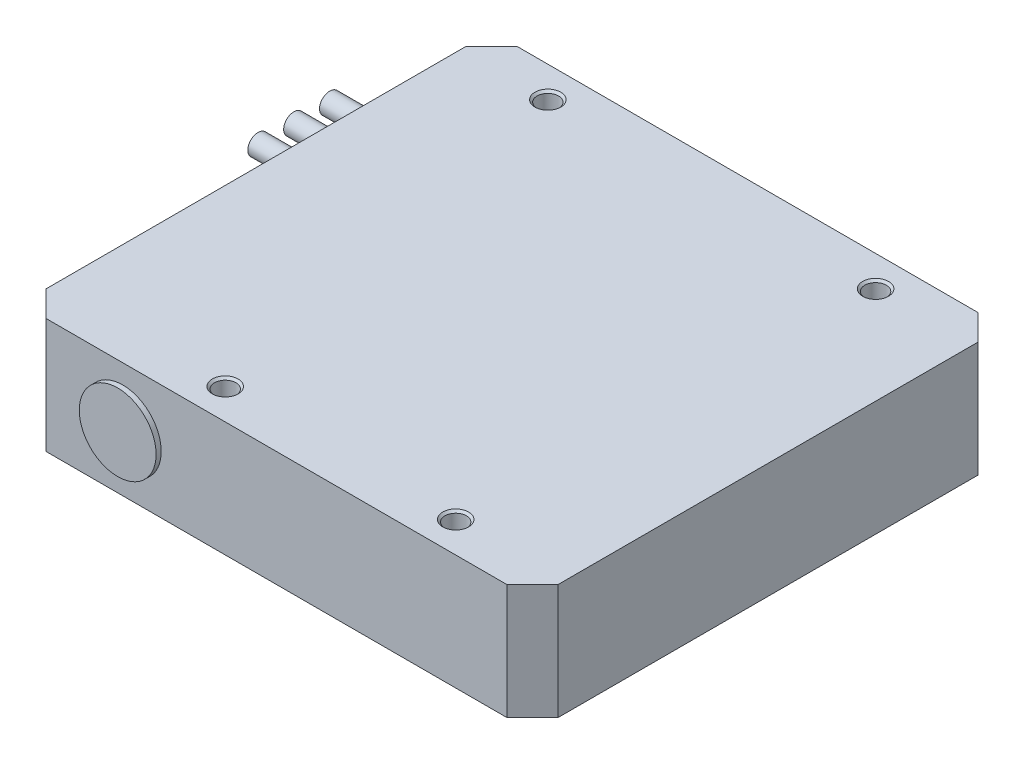
ISO-10303-21;
HEADER;
FILE_DESCRIPTION(('STEP AP214'),'2;1');
FILE_NAME('part.step','',(''),(''),'','','');
FILE_SCHEMA(('AUTOMOTIVE_DESIGN { 1 0 10303 214 1 1 1 1 }'));
ENDSEC;
DATA;
#1=APPLICATION_CONTEXT('core data for automotive mechanical design processes');
#2=APPLICATION_PROTOCOL_DEFINITION('international standard','automotive_design',2000,#1);
#3=PRODUCT_CONTEXT('',#1,'mechanical');
#4=PRODUCT('Part','Part','',(#3));
#5=PRODUCT_RELATED_PRODUCT_CATEGORY('part','',(#4));
#6=PRODUCT_DEFINITION_FORMATION('','',#4);
#7=PRODUCT_DEFINITION_CONTEXT('part definition',#1,'design');
#8=PRODUCT_DEFINITION('design','',#6,#7);
#9=PRODUCT_DEFINITION_SHAPE('','',#8);
#10=(LENGTH_UNIT() NAMED_UNIT(*) SI_UNIT(.MILLI.,.METRE.));
#11=(NAMED_UNIT(*) PLANE_ANGLE_UNIT() SI_UNIT($,.RADIAN.));
#12=(NAMED_UNIT(*) SI_UNIT($,.STERADIAN.) SOLID_ANGLE_UNIT());
#13=UNCERTAINTY_MEASURE_WITH_UNIT(LENGTH_MEASURE(1.E-05),#10,'distance_accuracy_value','');
#14=(GEOMETRIC_REPRESENTATION_CONTEXT(3) GLOBAL_UNCERTAINTY_ASSIGNED_CONTEXT((#13)) GLOBAL_UNIT_ASSIGNED_CONTEXT((#10,
#11,#12)) REPRESENTATION_CONTEXT('',''));
#15=CARTESIAN_POINT('',(0.,0.,0.));
#16=DIRECTION('',(0.,0.,1.));
#17=DIRECTION('',(1.,0.,0.));
#18=AXIS2_PLACEMENT_3D('',#15,#16,#17);
#19=CARTESIAN_POINT('',(50.,22.5,46.));
#20=DIRECTION('',(-1.,0.,0.));
#21=DIRECTION('',(0.,0.,1.));
#22=AXIS2_PLACEMENT_3D('',#19,#20,#21);
#23=PLANE('',#22);
#24=DIRECTION('',(0.,0.,-1.));
#25=VECTOR('',#24,1.);
#26=CARTESIAN_POINT('',(50.,0.,46.));
#27=LINE('',#26,#25);
#28=CARTESIAN_POINT('',(50.,0.,41.));
#29=VERTEX_POINT('',#28);
#30=CARTESIAN_POINT('',(50.,0.,-41.));
#31=VERTEX_POINT('',#30);
#32=EDGE_CURVE('E183',#29,#31,#27,.T.);
#33=ORIENTED_EDGE('',*,*,#32,.T.);
#34=DIRECTION('',(0.,1.,0.));
#35=VECTOR('',#34,1.);
#36=CARTESIAN_POINT('',(50.,22.5,-41.));
#37=LINE('',#36,#35);
#38=CARTESIAN_POINT('',(50.,22.5,-41.));
#39=VERTEX_POINT('',#38);
#40=EDGE_CURVE('E235',#31,#39,#37,.T.);
#41=ORIENTED_EDGE('',*,*,#40,.T.);
#42=DIRECTION('',(0.,0.,-1.));
#43=VECTOR('',#42,1.);
#44=CARTESIAN_POINT('',(50.,22.5,46.));
#45=LINE('',#44,#43);
#46=CARTESIAN_POINT('',(50.,22.5,41.));
#47=VERTEX_POINT('',#46);
#48=EDGE_CURVE('E184',#47,#39,#45,.T.);
#49=ORIENTED_EDGE('',*,*,#48,.F.);
#50=DIRECTION('',(0.,-1.,0.));
#51=VECTOR('',#50,1.);
#52=CARTESIAN_POINT('',(50.,22.5,41.));
#53=LINE('',#52,#51);
#54=EDGE_CURVE('E231',#47,#29,#53,.T.);
#55=ORIENTED_EDGE('',*,*,#54,.T.);
#56=EDGE_LOOP('',(#33,#41,#49,#55));
#57=FACE_BOUND('',#56,.T.);
#58=ADVANCED_FACE('F45',(#57),#23,.F.);
#59=CARTESIAN_POINT('',(-50.,22.5,-46.));
#60=DIRECTION('',(0.,0.,1.));
#61=DIRECTION('',(1.,0.,0.));
#62=AXIS2_PLACEMENT_3D('',#59,#60,#61);
#63=PLANE('',#62);
#64=DIRECTION('',(-1.,0.,0.));
#65=VECTOR('',#64,1.);
#66=CARTESIAN_POINT('',(-50.,22.5,-46.));
#67=LINE('',#66,#65);
#68=CARTESIAN_POINT('',(45.,22.5,-46.));
#69=VERTEX_POINT('',#68);
#70=CARTESIAN_POINT('',(-45.,22.5,-46.));
#71=VERTEX_POINT('',#70);
#72=EDGE_CURVE('E188',#69,#71,#67,.T.);
#73=ORIENTED_EDGE('',*,*,#72,.F.);
#74=DIRECTION('',(0.,-1.,0.));
#75=VECTOR('',#74,1.);
#76=CARTESIAN_POINT('',(45.,22.5,-46.));
#77=LINE('',#76,#75);
#78=CARTESIAN_POINT('',(45.,0.,-46.));
#79=VERTEX_POINT('',#78);
#80=EDGE_CURVE('E215',#69,#79,#77,.T.);
#81=ORIENTED_EDGE('',*,*,#80,.T.);
#82=DIRECTION('',(-1.,0.,0.));
#83=VECTOR('',#82,1.);
#84=CARTESIAN_POINT('',(-50.,0.,-46.));
#85=LINE('',#84,#83);
#86=CARTESIAN_POINT('',(-45.,0.,-46.));
#87=VERTEX_POINT('',#86);
#88=EDGE_CURVE('E203',#79,#87,#85,.T.);
#89=ORIENTED_EDGE('',*,*,#88,.T.);
#90=DIRECTION('',(0.,1.,0.));
#91=VECTOR('',#90,1.);
#92=CARTESIAN_POINT('',(-45.,22.5,-46.));
#93=LINE('',#92,#91);
#94=EDGE_CURVE('E199',#87,#71,#93,.T.);
#95=ORIENTED_EDGE('',*,*,#94,.T.);
#96=EDGE_LOOP('',(#73,#81,#89,#95));
#97=FACE_BOUND('',#96,.T.);
#98=ADVANCED_FACE('F279',(#97),#63,.F.);
#99=CARTESIAN_POINT('',(-50.,22.5,46.));
#100=DIRECTION('',(1.,0.,0.));
#101=DIRECTION('',(0.,0.,-1.));
#102=AXIS2_PLACEMENT_3D('',#99,#100,#101);
#103=PLANE('',#102);
#104=CARTESIAN_POINT('',(-50.,11.25,-15.4079239455651));
#105=DIRECTION('',(1.,0.,0.));
#106=DIRECTION('',(0.,0.,-1.));
#107=AXIS2_PLACEMENT_3D('',#104,#105,#106);
#108=CIRCLE('',#107,2.);
#109=CARTESIAN_POINT('',(-50.,11.25,-17.4079239455651));
#110=VERTEX_POINT('',#109);
#111=EDGE_CURVE('E11',#110,#110,#108,.F.);
#112=ORIENTED_EDGE('',*,*,#111,.F.);
#113=EDGE_LOOP('',(#112));
#114=FACE_BOUND('',#113,.T.);
#115=CARTESIAN_POINT('',(-50.,11.25,-22.4079239455651));
#116=DIRECTION('',(1.,0.,0.));
#117=DIRECTION('',(0.,0.,-1.));
#118=AXIS2_PLACEMENT_3D('',#115,#116,#117);
#119=CIRCLE('',#118,2.);
#120=CARTESIAN_POINT('',(-50.,11.25,-24.4079239455651));
#121=VERTEX_POINT('',#120);
#122=EDGE_CURVE('E55',#121,#121,#119,.F.);
#123=ORIENTED_EDGE('',*,*,#122,.F.);
#124=EDGE_LOOP('',(#123));
#125=FACE_BOUND('',#124,.T.);
#126=CARTESIAN_POINT('',(-50.,11.25,-29.4079239455651));
#127=DIRECTION('',(1.,0.,0.));
#128=DIRECTION('',(0.,0.,-1.));
#129=AXIS2_PLACEMENT_3D('',#126,#127,#128);
#130=CIRCLE('',#129,2.);
#131=CARTESIAN_POINT('',(-50.,11.25,-31.4079239455651));
#132=VERTEX_POINT('',#131);
#133=EDGE_CURVE('E266',#132,#132,#130,.F.);
#134=ORIENTED_EDGE('',*,*,#133,.F.);
#135=EDGE_LOOP('',(#134));
#136=FACE_BOUND('',#135,.T.);
#137=DIRECTION('',(0.,0.,1.));
#138=VECTOR('',#137,1.);
#139=CARTESIAN_POINT('',(-50.,22.5,46.));
#140=LINE('',#139,#138);
#141=CARTESIAN_POINT('',(-50.,22.5,-41.));
#142=VERTEX_POINT('',#141);
#143=CARTESIAN_POINT('',(-50.,22.5,41.));
#144=VERTEX_POINT('',#143);
#145=EDGE_CURVE('E193',#142,#144,#140,.T.);
#146=ORIENTED_EDGE('',*,*,#145,.F.);
#147=DIRECTION('',(0.,-1.,0.));
#148=VECTOR('',#147,1.);
#149=CARTESIAN_POINT('',(-50.,22.5,-41.));
#150=LINE('',#149,#148);
#151=CARTESIAN_POINT('',(-50.,0.,-41.));
#152=VERTEX_POINT('',#151);
#153=EDGE_CURVE('E252',#142,#152,#150,.T.);
#154=ORIENTED_EDGE('',*,*,#153,.T.);
#155=DIRECTION('',(0.,0.,1.));
#156=VECTOR('',#155,1.);
#157=CARTESIAN_POINT('',(-50.,0.,46.));
#158=LINE('',#157,#156);
#159=CARTESIAN_POINT('',(-50.,0.,41.));
#160=VERTEX_POINT('',#159);
#161=EDGE_CURVE('E207',#152,#160,#158,.T.);
#162=ORIENTED_EDGE('',*,*,#161,.T.);
#163=DIRECTION('',(0.,1.,0.));
#164=VECTOR('',#163,1.);
#165=CARTESIAN_POINT('',(-50.,22.5,41.));
#166=LINE('',#165,#164);
#167=EDGE_CURVE('E249',#160,#144,#166,.T.);
#168=ORIENTED_EDGE('',*,*,#167,.T.);
#169=EDGE_LOOP('',(#146,#154,#162,#168));
#170=FACE_BOUND('',#169,.T.);
#171=ADVANCED_FACE('F275',(#114,#125,#136,#170),#103,.F.);
#172=CARTESIAN_POINT('',(-50.,22.5,46.));
#173=DIRECTION('',(0.,0.,-1.));
#174=DIRECTION('',(-1.,0.,0.));
#175=AXIS2_PLACEMENT_3D('',#172,#173,#174);
#176=PLANE('',#175);
#177=CARTESIAN_POINT('',(-30.,11.25,46.));
#178=DIRECTION('',(0.,0.,-1.));
#179=DIRECTION('',(-1.,0.,0.));
#180=AXIS2_PLACEMENT_3D('',#177,#178,#179);
#181=CIRCLE('',#180,7.5);
#182=CARTESIAN_POINT('',(-37.5,11.25,46.));
#183=VERTEX_POINT('',#182);
#184=EDGE_CURVE('E262',#183,#183,#181,.F.);
#185=ORIENTED_EDGE('',*,*,#184,.F.);
#186=EDGE_LOOP('',(#185));
#187=FACE_BOUND('',#186,.T.);
#188=DIRECTION('',(1.,0.,0.));
#189=VECTOR('',#188,1.);
#190=CARTESIAN_POINT('',(-50.,22.5,46.));
#191=LINE('',#190,#189);
#192=CARTESIAN_POINT('',(-45.,22.5,46.));
#193=VERTEX_POINT('',#192);
#194=CARTESIAN_POINT('',(45.,22.5,46.));
#195=VERTEX_POINT('',#194);
#196=EDGE_CURVE('E196',#193,#195,#191,.T.);
#197=ORIENTED_EDGE('',*,*,#196,.F.);
#198=DIRECTION('',(0.,-1.,0.));
#199=VECTOR('',#198,1.);
#200=CARTESIAN_POINT('',(-45.,22.5,46.));
#201=LINE('',#200,#199);
#202=CARTESIAN_POINT('',(-45.,0.,46.));
#203=VERTEX_POINT('',#202);
#204=EDGE_CURVE('E258',#193,#203,#201,.T.);
#205=ORIENTED_EDGE('',*,*,#204,.T.);
#206=DIRECTION('',(1.,0.,0.));
#207=VECTOR('',#206,1.);
#208=CARTESIAN_POINT('',(-50.,0.,46.));
#209=LINE('',#208,#207);
#210=CARTESIAN_POINT('',(45.,0.,46.));
#211=VERTEX_POINT('',#210);
#212=EDGE_CURVE('E189',#203,#211,#209,.T.);
#213=ORIENTED_EDGE('',*,*,#212,.T.);
#214=DIRECTION('',(0.,1.,0.));
#215=VECTOR('',#214,1.);
#216=CARTESIAN_POINT('',(45.,22.5,46.));
#217=LINE('',#216,#215);
#218=EDGE_CURVE('E62',#211,#195,#217,.T.);
#219=ORIENTED_EDGE('',*,*,#218,.T.);
#220=EDGE_LOOP('',(#197,#205,#213,#219));
#221=FACE_BOUND('',#220,.T.);
#222=ADVANCED_FACE('F278',(#187,#221),#176,.F.);
#223=CARTESIAN_POINT('',(0.,22.5,0.));
#224=DIRECTION('',(0.,-1.,0.));
#225=DIRECTION('',(0.,0.,-1.));
#226=AXIS2_PLACEMENT_3D('',#223,#224,#225);
#227=PLANE('',#226);
#228=CARTESIAN_POINT('',(-33.,22.5,-40.));
#229=DIRECTION('',(0.,1.,0.));
#230=DIRECTION('',(0.,0.,1.));
#231=AXIS2_PLACEMENT_3D('',#228,#229,#230);
#232=CIRCLE('',#231,2.525);
#233=CARTESIAN_POINT('',(-33.,22.5,-37.475));
#234=VERTEX_POINT('',#233);
#235=EDGE_CURVE('E144',#234,#234,#232,.T.);
#236=ORIENTED_EDGE('',*,*,#235,.F.);
#237=EDGE_LOOP('',(#236));
#238=FACE_BOUND('',#237,.T.);
#239=CARTESIAN_POINT('',(31.,22.5,-40.));
#240=DIRECTION('',(0.,1.,0.));
#241=DIRECTION('',(0.,0.,1.));
#242=AXIS2_PLACEMENT_3D('',#239,#240,#241);
#243=CIRCLE('',#242,2.525);
#244=CARTESIAN_POINT('',(31.,22.5,-37.475));
#245=VERTEX_POINT('',#244);
#246=EDGE_CURVE('E135',#245,#245,#243,.T.);
#247=ORIENTED_EDGE('',*,*,#246,.F.);
#248=EDGE_LOOP('',(#247));
#249=FACE_BOUND('',#248,.T.);
#250=CARTESIAN_POINT('',(29.,22.5,40.));
#251=DIRECTION('',(0.,1.,0.));
#252=DIRECTION('',(0.,0.,1.));
#253=AXIS2_PLACEMENT_3D('',#250,#251,#252);
#254=CIRCLE('',#253,2.525);
#255=CARTESIAN_POINT('',(29.,22.5,42.525));
#256=VERTEX_POINT('',#255);
#257=EDGE_CURVE('E155',#256,#256,#254,.T.);
#258=ORIENTED_EDGE('',*,*,#257,.F.);
#259=EDGE_LOOP('',(#258));
#260=FACE_BOUND('',#259,.T.);
#261=CARTESIAN_POINT('',(-16.,22.5,40.));
#262=DIRECTION('',(0.,1.,0.));
#263=DIRECTION('',(0.,0.,1.));
#264=AXIS2_PLACEMENT_3D('',#261,#262,#263);
#265=CIRCLE('',#264,2.525);
#266=CARTESIAN_POINT('',(-16.,22.5,42.525));
#267=VERTEX_POINT('',#266);
#268=EDGE_CURVE('E167',#267,#267,#265,.T.);
#269=ORIENTED_EDGE('',*,*,#268,.F.);
#270=EDGE_LOOP('',(#269));
#271=FACE_BOUND('',#270,.T.);
#272=ORIENTED_EDGE('',*,*,#48,.T.);
#273=DIRECTION('',(0.707106781186547,0.,0.707106781186549));
#274=VECTOR('',#273,1.);
#275=CARTESIAN_POINT('',(45.,22.5,-46.));
#276=LINE('',#275,#274);
#277=EDGE_CURVE('E246',#39,#69,#276,.F.);
#278=ORIENTED_EDGE('',*,*,#277,.T.);
#279=ORIENTED_EDGE('',*,*,#72,.T.);
#280=DIRECTION('',(0.707106781186547,0.,-0.707106781186549));
#281=VECTOR('',#280,1.);
#282=CARTESIAN_POINT('',(-50.,22.5,-41.));
#283=LINE('',#282,#281);
#284=EDGE_CURVE('E243',#71,#142,#283,.F.);
#285=ORIENTED_EDGE('',*,*,#284,.T.);
#286=ORIENTED_EDGE('',*,*,#145,.T.);
#287=DIRECTION('',(-0.707106781186548,0.,-0.707106781186548));
#288=VECTOR('',#287,1.);
#289=CARTESIAN_POINT('',(-45.,22.5,46.));
#290=LINE('',#289,#288);
#291=EDGE_CURVE('E69',#144,#193,#290,.F.);
#292=ORIENTED_EDGE('',*,*,#291,.T.);
#293=ORIENTED_EDGE('',*,*,#196,.T.);
#294=DIRECTION('',(-0.707106781186548,0.,0.707106781186548));
#295=VECTOR('',#294,1.);
#296=CARTESIAN_POINT('',(50.,22.5,41.));
#297=LINE('',#296,#295);
#298=EDGE_CURVE('E238',#195,#47,#297,.F.);
#299=ORIENTED_EDGE('',*,*,#298,.T.);
#300=EDGE_LOOP('',(#272,#278,#279,#285,#286,#292,#293,#299));
#301=FACE_BOUND('',#300,.T.);
#302=ADVANCED_FACE('F341',(#238,#249,#260,#271,#301),#227,.F.);
#303=CARTESIAN_POINT('',(0.,0.,0.));
#304=DIRECTION('',(0.,-1.,0.));
#305=DIRECTION('',(0.,0.,-1.));
#306=AXIS2_PLACEMENT_3D('',#303,#304,#305);
#307=PLANE('',#306);
#308=ORIENTED_EDGE('',*,*,#88,.F.);
#309=DIRECTION('',(-0.707106781186547,0.,-0.707106781186549));
#310=VECTOR('',#309,1.);
#311=CARTESIAN_POINT('',(45.5000000000001,0.,-45.4999999999999));
#312=LINE('',#311,#310);
#313=EDGE_CURVE('E228',#79,#31,#312,.F.);
#314=ORIENTED_EDGE('',*,*,#313,.T.);
#315=ORIENTED_EDGE('',*,*,#32,.F.);
#316=DIRECTION('',(0.707106781186548,0.,-0.707106781186548));
#317=VECTOR('',#316,1.);
#318=CARTESIAN_POINT('',(45.5,0.,45.5));
#319=LINE('',#318,#317);
#320=EDGE_CURVE('E219',#29,#211,#319,.F.);
#321=ORIENTED_EDGE('',*,*,#320,.T.);
#322=ORIENTED_EDGE('',*,*,#212,.F.);
#323=DIRECTION('',(0.707106781186548,0.,0.707106781186548));
#324=VECTOR('',#323,1.);
#325=CARTESIAN_POINT('',(-45.5,0.,45.5));
#326=LINE('',#325,#324);
#327=EDGE_CURVE('E222',#203,#160,#326,.F.);
#328=ORIENTED_EDGE('',*,*,#327,.T.);
#329=ORIENTED_EDGE('',*,*,#161,.F.);
#330=DIRECTION('',(-0.707106781186547,0.,0.707106781186549));
#331=VECTOR('',#330,1.);
#332=CARTESIAN_POINT('',(-45.5000000000001,0.,-45.4999999999999));
#333=LINE('',#332,#331);
#334=EDGE_CURVE('E225',#152,#87,#333,.F.);
#335=ORIENTED_EDGE('',*,*,#334,.T.);
#336=EDGE_LOOP('',(#308,#314,#315,#321,#322,#328,#329,#335));
#337=FACE_BOUND('',#336,.T.);
#338=ADVANCED_FACE('F294',(#337),#307,.T.);
#339=CARTESIAN_POINT('',(45.,22.5,-46.));
#340=DIRECTION('',(-0.707106781186548,0.,0.707106781186546));
#341=DIRECTION('',(0.,-1.,0.));
#342=AXIS2_PLACEMENT_3D('',#339,#340,#341);
#343=PLANE('',#342);
#344=ORIENTED_EDGE('',*,*,#277,.F.);
#345=ORIENTED_EDGE('',*,*,#40,.F.);
#346=ORIENTED_EDGE('',*,*,#313,.F.);
#347=ORIENTED_EDGE('',*,*,#80,.F.);
#348=EDGE_LOOP('',(#344,#345,#346,#347));
#349=FACE_BOUND('',#348,.T.);
#350=ADVANCED_FACE('F300',(#349),#343,.F.);
#351=CARTESIAN_POINT('',(-50.,22.5,-41.));
#352=DIRECTION('',(0.707106781186549,0.,0.707106781186547));
#353=DIRECTION('',(0.,-1.,0.));
#354=AXIS2_PLACEMENT_3D('',#351,#352,#353);
#355=PLANE('',#354);
#356=ORIENTED_EDGE('',*,*,#284,.F.);
#357=ORIENTED_EDGE('',*,*,#94,.F.);
#358=ORIENTED_EDGE('',*,*,#334,.F.);
#359=ORIENTED_EDGE('',*,*,#153,.F.);
#360=EDGE_LOOP('',(#356,#357,#358,#359));
#361=FACE_BOUND('',#360,.T.);
#362=ADVANCED_FACE('F290',(#361),#355,.F.);
#363=CARTESIAN_POINT('',(-45.,22.5,46.));
#364=DIRECTION('',(0.707106781186547,0.,-0.707106781186547));
#365=DIRECTION('',(0.,-1.,0.));
#366=AXIS2_PLACEMENT_3D('',#363,#364,#365);
#367=PLANE('',#366);
#368=ORIENTED_EDGE('',*,*,#291,.F.);
#369=ORIENTED_EDGE('',*,*,#167,.F.);
#370=ORIENTED_EDGE('',*,*,#327,.F.);
#371=ORIENTED_EDGE('',*,*,#204,.F.);
#372=EDGE_LOOP('',(#368,#369,#370,#371));
#373=FACE_BOUND('',#372,.T.);
#374=ADVANCED_FACE('F311',(#373),#367,.F.);
#375=CARTESIAN_POINT('',(50.,22.5,41.));
#376=DIRECTION('',(-0.707106781186547,0.,-0.707106781186547));
#377=DIRECTION('',(0.,-1.,0.));
#378=AXIS2_PLACEMENT_3D('',#375,#376,#377);
#379=PLANE('',#378);
#380=ORIENTED_EDGE('',*,*,#298,.F.);
#381=ORIENTED_EDGE('',*,*,#218,.F.);
#382=ORIENTED_EDGE('',*,*,#320,.F.);
#383=ORIENTED_EDGE('',*,*,#54,.F.);
#384=EDGE_LOOP('',(#380,#381,#382,#383));
#385=FACE_BOUND('',#384,.T.);
#386=ADVANCED_FACE('F48',(#385),#379,.F.);
#387=CARTESIAN_POINT('',(-30.,11.25,47.));
#388=DIRECTION('',(0.,0.,-1.));
#389=DIRECTION('',(-1.,0.,0.));
#390=AXIS2_PLACEMENT_3D('',#387,#388,#389);
#391=CYLINDRICAL_SURFACE('',#390,7.5);
#392=CARTESIAN_POINT('',(-30.,11.25,47.));
#393=DIRECTION('',(0.,0.,1.));
#394=DIRECTION('',(1.,0.,0.));
#395=AXIS2_PLACEMENT_3D('',#392,#393,#394);
#396=CIRCLE('',#395,7.5);
#397=CARTESIAN_POINT('',(-22.5,11.25,47.));
#398=VERTEX_POINT('',#397);
#399=EDGE_CURVE('E179',#398,#398,#396,.T.);
#400=ORIENTED_EDGE('',*,*,#399,.F.);
#401=EDGE_LOOP('',(#400));
#402=FACE_BOUND('',#401,.T.);
#403=ORIENTED_EDGE('',*,*,#184,.T.);
#404=EDGE_LOOP('',(#403));
#405=FACE_BOUND('',#404,.T.);
#406=ADVANCED_FACE('F317',(#402,#405),#391,.T.);
#407=CARTESIAN_POINT('',(-30.,11.25,47.));
#408=DIRECTION('',(0.,0.,1.));
#409=DIRECTION('',(1.,0.,0.));
#410=AXIS2_PLACEMENT_3D('',#407,#408,#409);
#411=PLANE('',#410);
#412=ORIENTED_EDGE('',*,*,#399,.T.);
#413=EDGE_LOOP('',(#412));
#414=FACE_BOUND('',#413,.T.);
#415=ADVANCED_FACE('F357',(#414),#411,.T.);
#416=CARTESIAN_POINT('',(-16.,17.5,40.));
#417=DIRECTION('',(0.,1.,0.));
#418=DIRECTION('',(0.,0.,1.));
#419=AXIS2_PLACEMENT_3D('',#416,#417,#418);
#420=CONICAL_SURFACE('',#419,2.1,1.02974425867665);
#421=CARTESIAN_POINT('',(-16.,16.2381927000421,40.));
#422=VERTEX_POINT('',#421);
#423=VERTEX_LOOP('',#422);
#424=FACE_BOUND('',#423,.T.);
#425=CARTESIAN_POINT('',(-16.,17.5,40.));
#426=DIRECTION('',(0.,1.,0.));
#427=DIRECTION('',(0.,0.,1.));
#428=AXIS2_PLACEMENT_3D('',#425,#426,#427);
#429=CIRCLE('',#428,2.1);
#430=CARTESIAN_POINT('',(-16.,17.5,42.1));
#431=VERTEX_POINT('',#430);
#432=EDGE_CURVE('E175',#431,#431,#429,.T.);
#433=ORIENTED_EDGE('',*,*,#432,.T.);
#434=EDGE_LOOP('',(#433));
#435=FACE_BOUND('',#434,.T.);
#436=ADVANCED_FACE('F362',(#424,#435),#420,.F.);
#437=CARTESIAN_POINT('',(-16.,22.5,40.));
#438=DIRECTION('',(0.,1.,0.));
#439=DIRECTION('',(0.,0.,1.));
#440=AXIS2_PLACEMENT_3D('',#437,#438,#439);
#441=CYLINDRICAL_SURFACE('',#440,2.1);
#442=ORIENTED_EDGE('',*,*,#432,.F.);
#443=EDGE_LOOP('',(#442));
#444=FACE_BOUND('',#443,.T.);
#445=CARTESIAN_POINT('',(-16.,22.075,40.));
#446=DIRECTION('',(0.,1.,0.));
#447=DIRECTION('',(0.,0.,1.));
#448=AXIS2_PLACEMENT_3D('',#445,#446,#447);
#449=CIRCLE('',#448,2.1);
#450=CARTESIAN_POINT('',(-16.,22.075,42.1));
#451=VERTEX_POINT('',#450);
#452=EDGE_CURVE('E171',#451,#451,#449,.T.);
#453=ORIENTED_EDGE('',*,*,#452,.T.);
#454=EDGE_LOOP('',(#453));
#455=FACE_BOUND('',#454,.T.);
#456=ADVANCED_FACE('F369',(#444,#455),#441,.F.);
#457=CARTESIAN_POINT('',(-16.,22.5,40.));
#458=DIRECTION('',(0.,1.,0.));
#459=DIRECTION('',(0.,0.,1.));
#460=AXIS2_PLACEMENT_3D('',#457,#458,#459);
#461=CONICAL_SURFACE('',#460,2.525,0.785398163397444);
#462=ORIENTED_EDGE('',*,*,#452,.F.);
#463=EDGE_LOOP('',(#462));
#464=FACE_BOUND('',#463,.T.);
#465=ORIENTED_EDGE('',*,*,#268,.T.);
#466=EDGE_LOOP('',(#465));
#467=FACE_BOUND('',#466,.T.);
#468=ADVANCED_FACE('F373',(#464,#467),#461,.F.);
#469=CARTESIAN_POINT('',(29.,17.5,40.));
#470=DIRECTION('',(0.,1.,0.));
#471=DIRECTION('',(0.,0.,1.));
#472=AXIS2_PLACEMENT_3D('',#469,#470,#471);
#473=CONICAL_SURFACE('',#472,2.1,1.02974425867665);
#474=CARTESIAN_POINT('',(29.,16.2381927000421,40.));
#475=VERTEX_POINT('',#474);
#476=VERTEX_LOOP('',#475);
#477=FACE_BOUND('',#476,.T.);
#478=CARTESIAN_POINT('',(29.,17.5,40.));
#479=DIRECTION('',(0.,1.,0.));
#480=DIRECTION('',(0.,0.,1.));
#481=AXIS2_PLACEMENT_3D('',#478,#479,#480);
#482=CIRCLE('',#481,2.1);
#483=CARTESIAN_POINT('',(29.,17.5,42.1));
#484=VERTEX_POINT('',#483);
#485=EDGE_CURVE('E163',#484,#484,#482,.T.);
#486=ORIENTED_EDGE('',*,*,#485,.T.);
#487=EDGE_LOOP('',(#486));
#488=FACE_BOUND('',#487,.T.);
#489=ADVANCED_FACE('F377',(#477,#488),#473,.F.);
#490=CARTESIAN_POINT('',(29.,22.5,40.));
#491=DIRECTION('',(0.,1.,0.));
#492=DIRECTION('',(0.,0.,1.));
#493=AXIS2_PLACEMENT_3D('',#490,#491,#492);
#494=CYLINDRICAL_SURFACE('',#493,2.1);
#495=ORIENTED_EDGE('',*,*,#485,.F.);
#496=EDGE_LOOP('',(#495));
#497=FACE_BOUND('',#496,.T.);
#498=CARTESIAN_POINT('',(29.,22.075,40.));
#499=DIRECTION('',(0.,1.,0.));
#500=DIRECTION('',(0.,0.,1.));
#501=AXIS2_PLACEMENT_3D('',#498,#499,#500);
#502=CIRCLE('',#501,2.1);
#503=CARTESIAN_POINT('',(29.,22.075,42.1));
#504=VERTEX_POINT('',#503);
#505=EDGE_CURVE('E159',#504,#504,#502,.T.);
#506=ORIENTED_EDGE('',*,*,#505,.T.);
#507=EDGE_LOOP('',(#506));
#508=FACE_BOUND('',#507,.T.);
#509=ADVANCED_FACE('F381',(#497,#508),#494,.F.);
#510=CARTESIAN_POINT('',(29.,22.5,40.));
#511=DIRECTION('',(0.,1.,0.));
#512=DIRECTION('',(0.,0.,1.));
#513=AXIS2_PLACEMENT_3D('',#510,#511,#512);
#514=CONICAL_SURFACE('',#513,2.525,0.785398163397444);
#515=ORIENTED_EDGE('',*,*,#505,.F.);
#516=EDGE_LOOP('',(#515));
#517=FACE_BOUND('',#516,.T.);
#518=ORIENTED_EDGE('',*,*,#257,.T.);
#519=EDGE_LOOP('',(#518));
#520=FACE_BOUND('',#519,.T.);
#521=ADVANCED_FACE('F385',(#517,#520),#514,.F.);
#522=CARTESIAN_POINT('',(31.,17.5,-40.));
#523=DIRECTION('',(0.,1.,0.));
#524=DIRECTION('',(0.,0.,1.));
#525=AXIS2_PLACEMENT_3D('',#522,#523,#524);
#526=CONICAL_SURFACE('',#525,2.1,1.02974425867665);
#527=CARTESIAN_POINT('',(31.,16.2381927000421,-40.));
#528=VERTEX_POINT('',#527);
#529=VERTEX_LOOP('',#528);
#530=FACE_BOUND('',#529,.T.);
#531=CARTESIAN_POINT('',(31.,17.5,-40.));
#532=DIRECTION('',(0.,1.,0.));
#533=DIRECTION('',(0.,0.,1.));
#534=AXIS2_PLACEMENT_3D('',#531,#532,#533);
#535=CIRCLE('',#534,2.1);
#536=CARTESIAN_POINT('',(31.,17.5,-37.9));
#537=VERTEX_POINT('',#536);
#538=EDGE_CURVE('E151',#537,#537,#535,.T.);
#539=ORIENTED_EDGE('',*,*,#538,.T.);
#540=EDGE_LOOP('',(#539));
#541=FACE_BOUND('',#540,.T.);
#542=ADVANCED_FACE('F389',(#530,#541),#526,.F.);
#543=CARTESIAN_POINT('',(31.,22.5,-40.));
#544=DIRECTION('',(0.,1.,0.));
#545=DIRECTION('',(0.,0.,1.));
#546=AXIS2_PLACEMENT_3D('',#543,#544,#545);
#547=CYLINDRICAL_SURFACE('',#546,2.1);
#548=ORIENTED_EDGE('',*,*,#538,.F.);
#549=EDGE_LOOP('',(#548));
#550=FACE_BOUND('',#549,.T.);
#551=CARTESIAN_POINT('',(31.,22.075,-40.));
#552=DIRECTION('',(0.,1.,0.));
#553=DIRECTION('',(0.,0.,1.));
#554=AXIS2_PLACEMENT_3D('',#551,#552,#553);
#555=CIRCLE('',#554,2.1);
#556=CARTESIAN_POINT('',(31.,22.075,-37.9));
#557=VERTEX_POINT('',#556);
#558=EDGE_CURVE('E141',#557,#557,#555,.T.);
#559=ORIENTED_EDGE('',*,*,#558,.T.);
#560=EDGE_LOOP('',(#559));
#561=FACE_BOUND('',#560,.T.);
#562=ADVANCED_FACE('F393',(#550,#561),#547,.F.);
#563=CARTESIAN_POINT('',(31.,22.5,-40.));
#564=DIRECTION('',(0.,1.,0.));
#565=DIRECTION('',(0.,0.,1.));
#566=AXIS2_PLACEMENT_3D('',#563,#564,#565);
#567=CONICAL_SURFACE('',#566,2.525,0.785398163397436);
#568=ORIENTED_EDGE('',*,*,#558,.F.);
#569=EDGE_LOOP('',(#568));
#570=FACE_BOUND('',#569,.T.);
#571=ORIENTED_EDGE('',*,*,#246,.T.);
#572=EDGE_LOOP('',(#571));
#573=FACE_BOUND('',#572,.T.);
#574=ADVANCED_FACE('F128',(#570,#573),#567,.F.);
#575=CARTESIAN_POINT('',(-33.,17.5,-40.));
#576=DIRECTION('',(0.,1.,0.));
#577=DIRECTION('',(0.,0.,1.));
#578=AXIS2_PLACEMENT_3D('',#575,#576,#577);
#579=CONICAL_SURFACE('',#578,2.1,1.02974425867665);
#580=CARTESIAN_POINT('',(-33.,16.2381927000421,-40.));
#581=VERTEX_POINT('',#580);
#582=VERTEX_LOOP('',#581);
#583=FACE_BOUND('',#582,.T.);
#584=CARTESIAN_POINT('',(-33.,17.5,-40.));
#585=DIRECTION('',(0.,1.,0.));
#586=DIRECTION('',(0.,0.,1.));
#587=AXIS2_PLACEMENT_3D('',#584,#585,#586);
#588=CIRCLE('',#587,2.1);
#589=CARTESIAN_POINT('',(-33.,17.5,-37.9));
#590=VERTEX_POINT('',#589);
#591=EDGE_CURVE('E132',#590,#590,#588,.T.);
#592=ORIENTED_EDGE('',*,*,#591,.T.);
#593=EDGE_LOOP('',(#592));
#594=FACE_BOUND('',#593,.T.);
#595=ADVANCED_FACE('F124',(#583,#594),#579,.F.);
#596=CARTESIAN_POINT('',(-33.,22.5,-40.));
#597=DIRECTION('',(0.,1.,0.));
#598=DIRECTION('',(0.,0.,1.));
#599=AXIS2_PLACEMENT_3D('',#596,#597,#598);
#600=CYLINDRICAL_SURFACE('',#599,2.1);
#601=ORIENTED_EDGE('',*,*,#591,.F.);
#602=EDGE_LOOP('',(#601));
#603=FACE_BOUND('',#602,.T.);
#604=CARTESIAN_POINT('',(-33.,22.075,-40.));
#605=DIRECTION('',(0.,1.,0.));
#606=DIRECTION('',(0.,0.,1.));
#607=AXIS2_PLACEMENT_3D('',#604,#605,#606);
#608=CIRCLE('',#607,2.1);
#609=CARTESIAN_POINT('',(-33.,22.075,-37.9));
#610=VERTEX_POINT('',#609);
#611=EDGE_CURVE('E136',#610,#610,#608,.T.);
#612=ORIENTED_EDGE('',*,*,#611,.T.);
#613=EDGE_LOOP('',(#612));
#614=FACE_BOUND('',#613,.T.);
#615=ADVANCED_FACE('F127',(#603,#614),#600,.F.);
#616=CARTESIAN_POINT('',(-33.,22.5,-40.));
#617=DIRECTION('',(0.,1.,0.));
#618=DIRECTION('',(0.,0.,1.));
#619=AXIS2_PLACEMENT_3D('',#616,#617,#618);
#620=CONICAL_SURFACE('',#619,2.525,0.785398163397444);
#621=ORIENTED_EDGE('',*,*,#611,.F.);
#622=EDGE_LOOP('',(#621));
#623=FACE_BOUND('',#622,.T.);
#624=ORIENTED_EDGE('',*,*,#235,.T.);
#625=EDGE_LOOP('',(#624));
#626=FACE_BOUND('',#625,.T.);
#627=ADVANCED_FACE('F403',(#623,#626),#620,.F.);
#628=CARTESIAN_POINT('',(-65.,11.25,-29.4079239455651));
#629=DIRECTION('',(1.,0.,0.));
#630=DIRECTION('',(0.,0.,-1.));
#631=AXIS2_PLACEMENT_3D('',#628,#629,#630);
#632=CYLINDRICAL_SURFACE('',#631,2.);
#633=CARTESIAN_POINT('',(-65.,11.25,-29.4079239455651));
#634=DIRECTION('',(-1.,0.,0.));
#635=DIRECTION('',(0.,0.,1.));
#636=AXIS2_PLACEMENT_3D('',#633,#634,#635);
#637=CIRCLE('',#636,2.);
#638=CARTESIAN_POINT('',(-65.,11.25,-27.4079239455651));
#639=VERTEX_POINT('',#638);
#640=EDGE_CURVE('E439',#639,#639,#637,.T.);
#641=ORIENTED_EDGE('',*,*,#640,.F.);
#642=EDGE_LOOP('',(#641));
#643=FACE_BOUND('',#642,.T.);
#644=ORIENTED_EDGE('',*,*,#133,.T.);
#645=EDGE_LOOP('',(#644));
#646=FACE_BOUND('',#645,.T.);
#647=ADVANCED_FACE('F406',(#643,#646),#632,.T.);
#648=CARTESIAN_POINT('',(-65.,11.25,-29.4079239455651));
#649=DIRECTION('',(-1.,0.,0.));
#650=DIRECTION('',(0.,0.,1.));
#651=AXIS2_PLACEMENT_3D('',#648,#649,#650);
#652=PLANE('',#651);
#653=ORIENTED_EDGE('',*,*,#640,.T.);
#654=EDGE_LOOP('',(#653));
#655=FACE_BOUND('',#654,.T.);
#656=ADVANCED_FACE('F410',(#655),#652,.T.);
#657=CARTESIAN_POINT('',(-65.,11.25,-22.4079239455651));
#658=DIRECTION('',(1.,0.,0.));
#659=DIRECTION('',(0.,0.,-1.));
#660=AXIS2_PLACEMENT_3D('',#657,#658,#659);
#661=CYLINDRICAL_SURFACE('',#660,2.);
#662=CARTESIAN_POINT('',(-65.,11.25,-22.4079239455651));
#663=DIRECTION('',(-1.,0.,0.));
#664=DIRECTION('',(0.,0.,1.));
#665=AXIS2_PLACEMENT_3D('',#662,#663,#664);
#666=CIRCLE('',#665,2.);
#667=CARTESIAN_POINT('',(-65.,11.25,-20.4079239455651));
#668=VERTEX_POINT('',#667);
#669=EDGE_CURVE('E435',#668,#668,#666,.T.);
#670=ORIENTED_EDGE('',*,*,#669,.F.);
#671=EDGE_LOOP('',(#670));
#672=FACE_BOUND('',#671,.T.);
#673=ORIENTED_EDGE('',*,*,#122,.T.);
#674=EDGE_LOOP('',(#673));
#675=FACE_BOUND('',#674,.T.);
#676=ADVANCED_FACE('F273',(#672,#675),#661,.T.);
#677=CARTESIAN_POINT('',(-65.,11.25,-22.4079239455651));
#678=DIRECTION('',(-1.,0.,0.));
#679=DIRECTION('',(0.,0.,1.));
#680=AXIS2_PLACEMENT_3D('',#677,#678,#679);
#681=PLANE('',#680);
#682=ORIENTED_EDGE('',*,*,#669,.T.);
#683=EDGE_LOOP('',(#682));
#684=FACE_BOUND('',#683,.T.);
#685=ADVANCED_FACE('F417',(#684),#681,.T.);
#686=CARTESIAN_POINT('',(-65.,11.25,-15.4079239455651));
#687=DIRECTION('',(1.,0.,0.));
#688=DIRECTION('',(0.,0.,-1.));
#689=AXIS2_PLACEMENT_3D('',#686,#687,#688);
#690=CYLINDRICAL_SURFACE('',#689,2.);
#691=CARTESIAN_POINT('',(-65.,11.25,-15.4079239455651));
#692=DIRECTION('',(-1.,0.,0.));
#693=DIRECTION('',(0.,0.,1.));
#694=AXIS2_PLACEMENT_3D('',#691,#692,#693);
#695=CIRCLE('',#694,2.);
#696=CARTESIAN_POINT('',(-65.,11.25,-13.4079239455651));
#697=VERTEX_POINT('',#696);
#698=EDGE_CURVE('E433',#697,#697,#695,.T.);
#699=ORIENTED_EDGE('',*,*,#698,.F.);
#700=EDGE_LOOP('',(#699));
#701=FACE_BOUND('',#700,.T.);
#702=ORIENTED_EDGE('',*,*,#111,.T.);
#703=EDGE_LOOP('',(#702));
#704=FACE_BOUND('',#703,.T.);
#705=ADVANCED_FACE('F421',(#701,#704),#690,.T.);
#706=CARTESIAN_POINT('',(-65.,11.25,-15.4079239455651));
#707=DIRECTION('',(-1.,0.,0.));
#708=DIRECTION('',(0.,0.,1.));
#709=AXIS2_PLACEMENT_3D('',#706,#707,#708);
#710=PLANE('',#709);
#711=ORIENTED_EDGE('',*,*,#698,.T.);
#712=EDGE_LOOP('',(#711));
#713=FACE_BOUND('',#712,.T.);
#714=ADVANCED_FACE('F425',(#713),#710,.T.);
#715=CLOSED_SHELL('',(#58,#98,#171,#222,#302,#338,#350,#362,#374,#386,#406,#415,#436,#456,#468,
#489,#509,#521,#542,#562,#574,#595,#615,#627,#647,#656,#676,#685,#705,#714));
#716=MANIFOLD_SOLID_BREP('B2',#715);
#717=ADVANCED_BREP_SHAPE_REPRESENTATION('',(#18,#716),#14);
#718=SHAPE_DEFINITION_REPRESENTATION(#9,#717);
ENDSEC;
END-ISO-10303-21;
